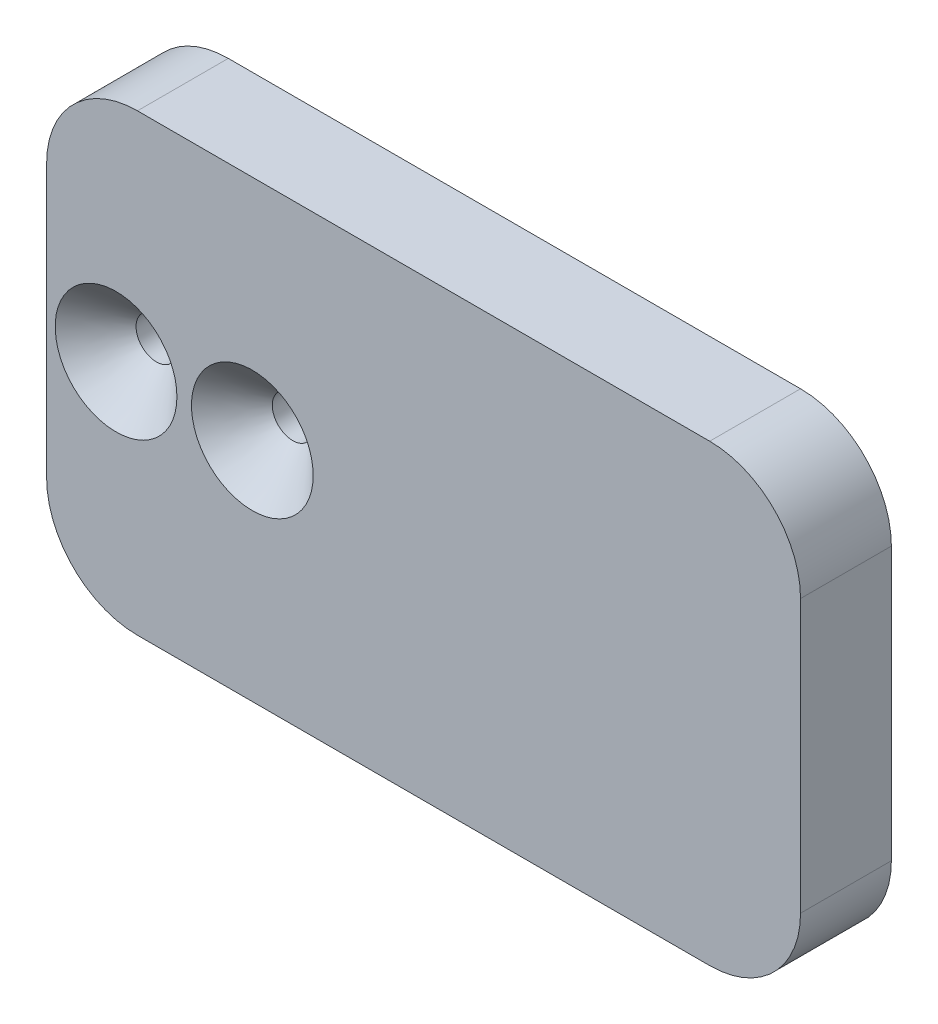
ISO-10303-21;
HEADER;
FILE_DESCRIPTION(('STEP AP214'),'2;1');
FILE_NAME('part.step','',(''),(''),'','','');
FILE_SCHEMA(('AUTOMOTIVE_DESIGN { 1 0 10303 214 1 1 1 1 }'));
ENDSEC;
DATA;
#1=APPLICATION_CONTEXT('core data for automotive mechanical design processes');
#2=APPLICATION_PROTOCOL_DEFINITION('international standard','automotive_design',2000,#1);
#3=PRODUCT_CONTEXT('',#1,'mechanical');
#4=PRODUCT('Part','Part','',(#3));
#5=PRODUCT_RELATED_PRODUCT_CATEGORY('part','',(#4));
#6=PRODUCT_DEFINITION_FORMATION('','',#4);
#7=PRODUCT_DEFINITION_CONTEXT('part definition',#1,'design');
#8=PRODUCT_DEFINITION('design','',#6,#7);
#9=PRODUCT_DEFINITION_SHAPE('','',#8);
#10=(LENGTH_UNIT() NAMED_UNIT(*) SI_UNIT(.MILLI.,.METRE.));
#11=(NAMED_UNIT(*) PLANE_ANGLE_UNIT() SI_UNIT($,.RADIAN.));
#12=(NAMED_UNIT(*) SI_UNIT($,.STERADIAN.) SOLID_ANGLE_UNIT());
#13=UNCERTAINTY_MEASURE_WITH_UNIT(LENGTH_MEASURE(1.E-05),#10,'distance_accuracy_value','');
#14=(GEOMETRIC_REPRESENTATION_CONTEXT(3) GLOBAL_UNCERTAINTY_ASSIGNED_CONTEXT((#13)) GLOBAL_UNIT_ASSIGNED_CONTEXT((#10,
#11,#12)) REPRESENTATION_CONTEXT('',''));
#15=CARTESIAN_POINT('',(0.,0.,0.));
#16=DIRECTION('',(0.,0.,1.));
#17=DIRECTION('',(1.,0.,0.));
#18=AXIS2_PLACEMENT_3D('',#15,#16,#17);
#19=CARTESIAN_POINT('',(-43.3601903788555,-3.481261930923,61.0555127546399));
#20=DIRECTION('',(0.,1.,0.));
#21=DIRECTION('',(0.,0.,1.));
#22=AXIS2_PLACEMENT_3D('',#19,#20,#21);
#23=PLANE('',#22);
#24=DIRECTION('',(0.,0.,-1.));
#25=VECTOR('',#24,1.);
#26=CARTESIAN_POINT('',(-43.3601903788555,-3.481261930923,61.0555127546399));
#27=LINE('',#26,#25);
#28=CARTESIAN_POINT('',(-43.3601903788555,-3.481261930923,5.));
#29=VERTEX_POINT('',#28);
#30=CARTESIAN_POINT('',(-43.3601903788555,-3.481261930923,3.));
#31=VERTEX_POINT('',#30);
#32=EDGE_CURVE('E378',#29,#31,#27,.T.);
#33=ORIENTED_EDGE('',*,*,#32,.T.);
#34=DIRECTION('',(1.,0.,0.));
#35=VECTOR('',#34,1.);
#36=CARTESIAN_POINT('',(-43.3601903788555,-3.481261930923,3.));
#37=LINE('',#36,#35);
#38=CARTESIAN_POINT('',(-13.3601903788555,-3.481261930923,3.));
#39=VERTEX_POINT('',#38);
#40=EDGE_CURVE('E430',#31,#39,#37,.T.);
#41=ORIENTED_EDGE('',*,*,#40,.T.);
#42=DIRECTION('',(0.,0.,-1.));
#43=VECTOR('',#42,1.);
#44=CARTESIAN_POINT('',(-13.3601903788555,-3.481261930923,61.0555127546399));
#45=LINE('',#44,#43);
#46=CARTESIAN_POINT('',(-13.3601903788555,-3.481261930923,5.));
#47=VERTEX_POINT('',#46);
#48=EDGE_CURVE('E381',#47,#39,#45,.T.);
#49=ORIENTED_EDGE('',*,*,#48,.F.);
#50=DIRECTION('',(1.,0.,0.));
#51=VECTOR('',#50,1.);
#52=CARTESIAN_POINT('',(-43.3601903788555,-3.481261930923,5.));
#53=LINE('',#52,#51);
#54=EDGE_CURVE('E274',#47,#29,#53,.F.);
#55=ORIENTED_EDGE('',*,*,#54,.T.);
#56=EDGE_LOOP('',(#33,#41,#49,#55));
#57=FACE_BOUND('',#56,.T.);
#58=ADVANCED_FACE('F53',(#57),#23,.F.);
#59=CARTESIAN_POINT('',(-13.3601903788555,16.518738069077,61.0555127546399));
#60=DIRECTION('',(-1.,0.,0.));
#61=DIRECTION('',(0.,0.,1.));
#62=AXIS2_PLACEMENT_3D('',#59,#60,#61);
#63=PLANE('',#62);
#64=ORIENTED_EDGE('',*,*,#48,.T.);
#65=DIRECTION('',(0.,1.,0.));
#66=VECTOR('',#65,1.);
#67=CARTESIAN_POINT('',(-13.3601903788555,16.518738069077,3.));
#68=LINE('',#67,#66);
#69=CARTESIAN_POINT('',(-13.3601903788555,16.518738069077,3.));
#70=VERTEX_POINT('',#69);
#71=EDGE_CURVE('E394',#39,#70,#68,.T.);
#72=ORIENTED_EDGE('',*,*,#71,.T.);
#73=DIRECTION('',(0.,0.,-1.));
#74=VECTOR('',#73,1.);
#75=CARTESIAN_POINT('',(-13.3601903788555,16.518738069077,61.0555127546399));
#76=LINE('',#75,#74);
#77=CARTESIAN_POINT('',(-13.3601903788555,16.518738069077,5.));
#78=VERTEX_POINT('',#77);
#79=EDGE_CURVE('E221',#78,#70,#76,.T.);
#80=ORIENTED_EDGE('',*,*,#79,.F.);
#81=DIRECTION('',(0.,1.,0.));
#82=VECTOR('',#81,1.);
#83=CARTESIAN_POINT('',(-13.3601903788555,-3.481261930923,5.));
#84=LINE('',#83,#82);
#85=EDGE_CURVE('E277',#78,#47,#84,.F.);
#86=ORIENTED_EDGE('',*,*,#85,.T.);
#87=EDGE_LOOP('',(#64,#72,#80,#86));
#88=FACE_BOUND('',#87,.T.);
#89=ADVANCED_FACE('F325',(#88),#63,.F.);
#90=CARTESIAN_POINT('',(-43.3601903788555,16.518738069077,61.0555127546399));
#91=DIRECTION('',(0.,-1.,0.));
#92=DIRECTION('',(0.,0.,-1.));
#93=AXIS2_PLACEMENT_3D('',#90,#91,#92);
#94=PLANE('',#93);
#95=ORIENTED_EDGE('',*,*,#79,.T.);
#96=DIRECTION('',(-1.,0.,0.));
#97=VECTOR('',#96,1.);
#98=CARTESIAN_POINT('',(-43.3601903788555,16.518738069077,3.));
#99=LINE('',#98,#97);
#100=CARTESIAN_POINT('',(-43.3601903788555,16.518738069077,3.));
#101=VERTEX_POINT('',#100);
#102=EDGE_CURVE('E63',#70,#101,#99,.T.);
#103=ORIENTED_EDGE('',*,*,#102,.T.);
#104=DIRECTION('',(0.,0.,-1.));
#105=VECTOR('',#104,1.);
#106=CARTESIAN_POINT('',(-43.3601903788555,16.518738069077,61.0555127546399));
#107=LINE('',#106,#105);
#108=CARTESIAN_POINT('',(-43.3601903788555,16.518738069077,5.));
#109=VERTEX_POINT('',#108);
#110=EDGE_CURVE('E224',#109,#101,#107,.T.);
#111=ORIENTED_EDGE('',*,*,#110,.F.);
#112=DIRECTION('',(-1.,0.,0.));
#113=VECTOR('',#112,1.);
#114=CARTESIAN_POINT('',(-13.3601903788555,16.518738069077,5.));
#115=LINE('',#114,#113);
#116=EDGE_CURVE('E280',#109,#78,#115,.F.);
#117=ORIENTED_EDGE('',*,*,#116,.T.);
#118=EDGE_LOOP('',(#95,#103,#111,#117));
#119=FACE_BOUND('',#118,.T.);
#120=ADVANCED_FACE('F330',(#119),#94,.F.);
#121=CARTESIAN_POINT('',(-43.3601903788555,16.518738069077,61.0555127546399));
#122=DIRECTION('',(1.,0.,0.));
#123=DIRECTION('',(0.,0.,-1.));
#124=AXIS2_PLACEMENT_3D('',#121,#122,#123);
#125=PLANE('',#124);
#126=ORIENTED_EDGE('',*,*,#110,.T.);
#127=DIRECTION('',(0.,-1.,0.));
#128=VECTOR('',#127,1.);
#129=CARTESIAN_POINT('',(-43.3601903788555,16.518738069077,3.));
#130=LINE('',#129,#128);
#131=EDGE_CURVE('E11',#101,#31,#130,.T.);
#132=ORIENTED_EDGE('',*,*,#131,.T.);
#133=ORIENTED_EDGE('',*,*,#32,.F.);
#134=CARTESIAN_POINT('',(-43.3601903788555,-13.481261930923,5.));
#135=DIRECTION('',(1.,0.,0.));
#136=DIRECTION('',(0.,0.,-1.));
#137=AXIS2_PLACEMENT_3D('',#134,#135,#136);
#138=CIRCLE('',#137,10.);
#139=CARTESIAN_POINT('',(-43.3601903788555,-8.48126193092301,13.6602540378444));
#140=VERTEX_POINT('',#139);
#141=EDGE_CURVE('E283',#29,#140,#138,.T.);
#142=ORIENTED_EDGE('',*,*,#141,.T.);
#143=DIRECTION('',(0.,0.,1.));
#144=VECTOR('',#143,1.);
#145=CARTESIAN_POINT('',(-43.3601903788555,-8.48126193092301,25.));
#146=LINE('',#145,#144);
#147=CARTESIAN_POINT('',(-43.3601903788555,-8.48126193092301,25.));
#148=VERTEX_POINT('',#147);
#149=EDGE_CURVE('E260',#140,#148,#146,.T.);
#150=ORIENTED_EDGE('',*,*,#149,.T.);
#151=DIRECTION('',(0.,-1.,0.));
#152=VECTOR('',#151,1.);
#153=CARTESIAN_POINT('',(-43.3601903788555,16.518738069077,25.));
#154=LINE('',#153,#152);
#155=CARTESIAN_POINT('',(-43.3601903788555,21.518738069077,25.));
#156=VERTEX_POINT('',#155);
#157=EDGE_CURVE('E211',#156,#148,#154,.T.);
#158=ORIENTED_EDGE('',*,*,#157,.F.);
#159=DIRECTION('',(0.,0.,1.));
#160=VECTOR('',#159,1.);
#161=CARTESIAN_POINT('',(-43.3601903788555,21.518738069077,15.));
#162=LINE('',#161,#160);
#163=CARTESIAN_POINT('',(-43.3601903788555,21.518738069077,13.6602540378444));
#164=VERTEX_POINT('',#163);
#165=EDGE_CURVE('E257',#156,#164,#162,.F.);
#166=ORIENTED_EDGE('',*,*,#165,.T.);
#167=CARTESIAN_POINT('',(-43.3601903788555,26.518738069077,5.));
#168=DIRECTION('',(1.,0.,0.));
#169=DIRECTION('',(0.,0.,-1.));
#170=AXIS2_PLACEMENT_3D('',#167,#168,#169);
#171=CIRCLE('',#170,10.);
#172=EDGE_CURVE('E414',#164,#109,#171,.T.);
#173=ORIENTED_EDGE('',*,*,#172,.T.);
#174=EDGE_LOOP('',(#126,#132,#133,#142,#150,#158,#166,#173));
#175=FACE_BOUND('',#174,.T.);
#176=ADVANCED_FACE('F335',(#175),#125,.F.);
#177=CARTESIAN_POINT('',(0.,0.,0.));
#178=DIRECTION('',(0.,0.,1.));
#179=DIRECTION('',(1.,0.,0.));
#180=AXIS2_PLACEMENT_3D('',#177,#178,#179);
#181=PLANE('',#180);
#182=DIRECTION('',(-1.,0.,0.));
#183=VECTOR('',#182,1.);
#184=CARTESIAN_POINT('',(0.,13.518738069077,0.));
#185=LINE('',#184,#183);
#186=CARTESIAN_POINT('',(-40.3601903788555,13.518738069077,0.));
#187=VERTEX_POINT('',#186);
#188=CARTESIAN_POINT('',(-16.3601903788555,13.518738069077,0.));
#189=VERTEX_POINT('',#188);
#190=EDGE_CURVE('E420',#187,#189,#185,.F.);
#191=ORIENTED_EDGE('',*,*,#190,.T.);
#192=DIRECTION('',(0.,1.,0.));
#193=VECTOR('',#192,1.);
#194=CARTESIAN_POINT('',(-16.3601903788555,0.,0.));
#195=LINE('',#194,#193);
#196=CARTESIAN_POINT('',(-16.3601903788555,-0.481261930923005,0.));
#197=VERTEX_POINT('',#196);
#198=EDGE_CURVE('E426',#189,#197,#195,.F.);
#199=ORIENTED_EDGE('',*,*,#198,.T.);
#200=DIRECTION('',(1.,0.,0.));
#201=VECTOR('',#200,1.);
#202=CARTESIAN_POINT('',(0.,-0.481261930923005,0.));
#203=LINE('',#202,#201);
#204=CARTESIAN_POINT('',(-40.3601903788555,-0.481261930923005,0.));
#205=VERTEX_POINT('',#204);
#206=EDGE_CURVE('E423',#197,#205,#203,.F.);
#207=ORIENTED_EDGE('',*,*,#206,.T.);
#208=DIRECTION('',(0.,-1.,0.));
#209=VECTOR('',#208,1.);
#210=CARTESIAN_POINT('',(-40.3601903788555,0.,0.));
#211=LINE('',#210,#209);
#212=EDGE_CURVE('E418',#205,#187,#211,.F.);
#213=ORIENTED_EDGE('',*,*,#212,.T.);
#214=EDGE_LOOP('',(#191,#199,#207,#213));
#215=FACE_BOUND('',#214,.T.);
#216=CARTESIAN_POINT('',(-35.7149413892325,6.42187629455118,0.));
#217=DIRECTION('',(0.,0.,1.));
#218=DIRECTION('',(1.,0.,0.));
#219=AXIS2_PLACEMENT_3D('',#216,#217,#218);
#220=CIRCLE('',#219,2.25);
#221=CARTESIAN_POINT('',(-33.4649413892325,6.42187629455118,0.));
#222=VERTEX_POINT('',#221);
#223=EDGE_CURVE('E665',#222,#222,#220,.T.);
#224=ORIENTED_EDGE('',*,*,#223,.T.);
#225=EDGE_LOOP('',(#224));
#226=FACE_BOUND('',#225,.T.);
#227=CARTESIAN_POINT('',(-20.7149413892325,6.42187629455118,0.));
#228=DIRECTION('',(0.,0.,1.));
#229=DIRECTION('',(1.,0.,0.));
#230=AXIS2_PLACEMENT_3D('',#227,#228,#229);
#231=CIRCLE('',#230,2.25);
#232=CARTESIAN_POINT('',(-18.4649413892325,6.42187629455118,0.));
#233=VERTEX_POINT('',#232);
#234=EDGE_CURVE('E373',#233,#233,#231,.T.);
#235=ORIENTED_EDGE('',*,*,#234,.T.);
#236=EDGE_LOOP('',(#235));
#237=FACE_BOUND('',#236,.T.);
#238=ADVANCED_FACE('F338',(#215,#226,#237),#181,.F.);
#239=CARTESIAN_POINT('',(0.,0.,25.));
#240=DIRECTION('',(0.,0.,1.));
#241=DIRECTION('',(1.,0.,0.));
#242=AXIS2_PLACEMENT_3D('',#239,#240,#241);
#243=PLANE('',#242);
#244=CARTESIAN_POINT('',(-35.7149413892325,6.42187629455118,25.));
#245=DIRECTION('',(0.,0.,1.));
#246=DIRECTION('',(1.,0.,0.));
#247=AXIS2_PLACEMENT_3D('',#244,#245,#246);
#248=CIRCLE('',#247,6.7);
#249=CARTESIAN_POINT('',(-29.0149413892325,6.42187629455118,25.));
#250=VERTEX_POINT('',#249);
#251=EDGE_CURVE('E403',#250,#250,#248,.T.);
#252=ORIENTED_EDGE('',*,*,#251,.F.);
#253=EDGE_LOOP('',(#252));
#254=FACE_BOUND('',#253,.T.);
#255=CARTESIAN_POINT('',(-20.7149413892325,6.42187629455118,25.));
#256=DIRECTION('',(0.,0.,1.));
#257=DIRECTION('',(1.,0.,0.));
#258=AXIS2_PLACEMENT_3D('',#255,#256,#257);
#259=CIRCLE('',#258,6.7);
#260=CARTESIAN_POINT('',(-14.0149413892325,6.42187629455118,25.));
#261=VERTEX_POINT('',#260);
#262=EDGE_CURVE('E675',#261,#261,#259,.T.);
#263=ORIENTED_EDGE('',*,*,#262,.F.);
#264=EDGE_LOOP('',(#263));
#265=FACE_BOUND('',#264,.T.);
#266=DIRECTION('',(0.,1.,0.));
#267=VECTOR('',#266,1.);
#268=CARTESIAN_POINT('',(39.6398096211445,-18.481261930923,25.));
#269=LINE('',#268,#267);
#270=CARTESIAN_POINT('',(39.6398096211445,-8.481261930923,25.));
#271=VERTEX_POINT('',#270);
#272=CARTESIAN_POINT('',(39.6398096211445,21.518738069077,25.));
#273=VERTEX_POINT('',#272);
#274=EDGE_CURVE('E185',#271,#273,#269,.T.);
#275=ORIENTED_EDGE('',*,*,#274,.T.);
#276=CARTESIAN_POINT('',(29.6398096211445,21.518738069077,25.));
#277=DIRECTION('',(0.,0.,1.));
#278=DIRECTION('',(1.,0.,0.));
#279=AXIS2_PLACEMENT_3D('',#276,#277,#278);
#280=CIRCLE('',#279,10.);
#281=CARTESIAN_POINT('',(29.6398096211445,31.518738069077,25.));
#282=VERTEX_POINT('',#281);
#283=EDGE_CURVE('E193',#273,#282,#280,.T.);
#284=ORIENTED_EDGE('',*,*,#283,.T.);
#285=DIRECTION('',(-1.,0.,0.));
#286=VECTOR('',#285,1.);
#287=CARTESIAN_POINT('',(39.6398096211445,31.518738069077,25.));
#288=LINE('',#287,#286);
#289=CARTESIAN_POINT('',(-33.3601903788555,31.518738069077,25.));
#290=VERTEX_POINT('',#289);
#291=EDGE_CURVE('E205',#282,#290,#288,.T.);
#292=ORIENTED_EDGE('',*,*,#291,.T.);
#293=CARTESIAN_POINT('',(-33.3601903788555,21.518738069077,25.));
#294=DIRECTION('',(0.,0.,1.));
#295=DIRECTION('',(1.,0.,0.));
#296=AXIS2_PLACEMENT_3D('',#293,#294,#295);
#297=CIRCLE('',#296,10.);
#298=EDGE_CURVE('E217',#290,#156,#297,.T.);
#299=ORIENTED_EDGE('',*,*,#298,.T.);
#300=ORIENTED_EDGE('',*,*,#157,.T.);
#301=CARTESIAN_POINT('',(-33.3601903788555,-8.48126193092301,25.));
#302=DIRECTION('',(0.,0.,1.));
#303=DIRECTION('',(1.,0.,0.));
#304=AXIS2_PLACEMENT_3D('',#301,#302,#303);
#305=CIRCLE('',#304,10.);
#306=CARTESIAN_POINT('',(-33.3601903788555,-18.481261930923,25.));
#307=VERTEX_POINT('',#306);
#308=EDGE_CURVE('E194',#148,#307,#305,.T.);
#309=ORIENTED_EDGE('',*,*,#308,.T.);
#310=DIRECTION('',(1.,0.,0.));
#311=VECTOR('',#310,1.);
#312=CARTESIAN_POINT('',(39.6398096211445,-18.481261930923,25.));
#313=LINE('',#312,#311);
#314=CARTESIAN_POINT('',(29.6398096211445,-18.481261930923,25.));
#315=VERTEX_POINT('',#314);
#316=EDGE_CURVE('E187',#307,#315,#313,.T.);
#317=ORIENTED_EDGE('',*,*,#316,.T.);
#318=CARTESIAN_POINT('',(29.6398096211445,-8.481261930923,25.));
#319=DIRECTION('',(0.,0.,1.));
#320=DIRECTION('',(1.,0.,0.));
#321=AXIS2_PLACEMENT_3D('',#318,#319,#320);
#322=CIRCLE('',#321,10.);
#323=EDGE_CURVE('E182',#315,#271,#322,.T.);
#324=ORIENTED_EDGE('',*,*,#323,.T.);
#325=EDGE_LOOP('',(#275,#284,#292,#299,#300,#309,#317,#324));
#326=FACE_BOUND('',#325,.T.);
#327=ADVANCED_FACE('F184',(#254,#265,#326),#243,.T.);
#328=CARTESIAN_POINT('',(0.,0.,15.));
#329=DIRECTION('',(0.,0.,1.));
#330=DIRECTION('',(1.,0.,0.));
#331=AXIS2_PLACEMENT_3D('',#328,#329,#330);
#332=PLANE('',#331);
#333=CARTESIAN_POINT('',(-33.3601903788555,-8.48126193092301,15.));
#334=DIRECTION('',(0.,0.,1.));
#335=DIRECTION('',(1.,0.,0.));
#336=AXIS2_PLACEMENT_3D('',#333,#334,#335);
#337=CIRCLE('',#336,10.);
#338=CARTESIAN_POINT('',(-33.3601903788555,-18.481261930923,15.));
#339=VERTEX_POINT('',#338);
#340=CARTESIAN_POINT('',(-42.0204444166999,-13.481261930923,15.));
#341=VERTEX_POINT('',#340);
#342=EDGE_CURVE('E242',#339,#341,#337,.F.);
#343=ORIENTED_EDGE('',*,*,#342,.T.);
#344=DIRECTION('',(1.,0.,0.));
#345=VECTOR('',#344,1.);
#346=CARTESIAN_POINT('',(-13.3601903788555,-13.481261930923,15.));
#347=LINE('',#346,#345);
#348=CARTESIAN_POINT('',(-3.3601903788555,-13.481261930923,15.));
#349=VERTEX_POINT('',#348);
#350=EDGE_CURVE('E270',#341,#349,#347,.T.);
#351=ORIENTED_EDGE('',*,*,#350,.T.);
#352=DIRECTION('',(0.,1.,0.));
#353=VECTOR('',#352,1.);
#354=CARTESIAN_POINT('',(-3.3601903788555,16.518738069077,15.));
#355=LINE('',#354,#353);
#356=CARTESIAN_POINT('',(-3.3601903788555,26.518738069077,15.));
#357=VERTEX_POINT('',#356);
#358=EDGE_CURVE('E267',#349,#357,#355,.T.);
#359=ORIENTED_EDGE('',*,*,#358,.T.);
#360=DIRECTION('',(-1.,0.,0.));
#361=VECTOR('',#360,1.);
#362=CARTESIAN_POINT('',(-43.3601903788555,26.518738069077,15.));
#363=LINE('',#362,#361);
#364=CARTESIAN_POINT('',(-42.0204444166999,26.518738069077,15.));
#365=VERTEX_POINT('',#364);
#366=EDGE_CURVE('E264',#357,#365,#363,.T.);
#367=ORIENTED_EDGE('',*,*,#366,.T.);
#368=CARTESIAN_POINT('',(-33.3601903788555,21.518738069077,15.));
#369=DIRECTION('',(0.,0.,1.));
#370=DIRECTION('',(1.,0.,0.));
#371=AXIS2_PLACEMENT_3D('',#368,#369,#370);
#372=CIRCLE('',#371,10.);
#373=CARTESIAN_POINT('',(-33.3601903788555,31.518738069077,15.));
#374=VERTEX_POINT('',#373);
#375=EDGE_CURVE('E239',#365,#374,#372,.F.);
#376=ORIENTED_EDGE('',*,*,#375,.T.);
#377=DIRECTION('',(-1.,0.,0.));
#378=VECTOR('',#377,1.);
#379=CARTESIAN_POINT('',(39.6398096211445,31.518738069077,15.));
#380=LINE('',#379,#378);
#381=CARTESIAN_POINT('',(29.6398096211445,31.518738069077,15.));
#382=VERTEX_POINT('',#381);
#383=EDGE_CURVE('E358',#382,#374,#380,.T.);
#384=ORIENTED_EDGE('',*,*,#383,.F.);
#385=CARTESIAN_POINT('',(29.6398096211445,21.518738069077,15.));
#386=DIRECTION('',(0.,0.,1.));
#387=DIRECTION('',(1.,0.,0.));
#388=AXIS2_PLACEMENT_3D('',#385,#386,#387);
#389=CIRCLE('',#388,10.);
#390=CARTESIAN_POINT('',(39.6398096211445,21.518738069077,15.));
#391=VERTEX_POINT('',#390);
#392=EDGE_CURVE('E248',#382,#391,#389,.F.);
#393=ORIENTED_EDGE('',*,*,#392,.T.);
#394=DIRECTION('',(0.,1.,0.));
#395=VECTOR('',#394,1.);
#396=CARTESIAN_POINT('',(39.6398096211445,-18.481261930923,15.));
#397=LINE('',#396,#395);
#398=CARTESIAN_POINT('',(39.6398096211445,-8.481261930923,15.));
#399=VERTEX_POINT('',#398);
#400=EDGE_CURVE('E356',#399,#391,#397,.T.);
#401=ORIENTED_EDGE('',*,*,#400,.F.);
#402=CARTESIAN_POINT('',(29.6398096211445,-8.481261930923,15.));
#403=DIRECTION('',(0.,0.,1.));
#404=DIRECTION('',(1.,0.,0.));
#405=AXIS2_PLACEMENT_3D('',#402,#403,#404);
#406=CIRCLE('',#405,10.);
#407=CARTESIAN_POINT('',(29.6398096211445,-18.481261930923,15.));
#408=VERTEX_POINT('',#407);
#409=EDGE_CURVE('E209',#399,#408,#406,.F.);
#410=ORIENTED_EDGE('',*,*,#409,.T.);
#411=DIRECTION('',(1.,0.,0.));
#412=VECTOR('',#411,1.);
#413=CARTESIAN_POINT('',(39.6398096211445,-18.481261930923,15.));
#414=LINE('',#413,#412);
#415=EDGE_CURVE('E360',#339,#408,#414,.T.);
#416=ORIENTED_EDGE('',*,*,#415,.F.);
#417=EDGE_LOOP('',(#343,#351,#359,#367,#376,#384,#393,#401,#410,#416));
#418=FACE_BOUND('',#417,.T.);
#419=ADVANCED_FACE('F340',(#418),#332,.F.);
#420=CARTESIAN_POINT('',(39.6398096211445,31.518738069077,15.));
#421=DIRECTION('',(0.,1.,0.));
#422=DIRECTION('',(-1.,0.,0.));
#423=AXIS2_PLACEMENT_3D('',#420,#421,#422);
#424=PLANE('',#423);
#425=ORIENTED_EDGE('',*,*,#291,.F.);
#426=DIRECTION('',(0.,0.,1.));
#427=VECTOR('',#426,1.);
#428=CARTESIAN_POINT('',(29.6398096211445,31.518738069077,15.));
#429=LINE('',#428,#427);
#430=EDGE_CURVE('E236',#282,#382,#429,.F.);
#431=ORIENTED_EDGE('',*,*,#430,.T.);
#432=ORIENTED_EDGE('',*,*,#383,.T.);
#433=DIRECTION('',(0.,0.,1.));
#434=VECTOR('',#433,1.);
#435=CARTESIAN_POINT('',(-33.3601903788555,31.518738069077,25.));
#436=LINE('',#435,#434);
#437=EDGE_CURVE('E232',#374,#290,#436,.T.);
#438=ORIENTED_EDGE('',*,*,#437,.T.);
#439=EDGE_LOOP('',(#425,#431,#432,#438));
#440=FACE_BOUND('',#439,.T.);
#441=ADVANCED_FACE('F468',(#440),#424,.T.);
#442=CARTESIAN_POINT('',(39.6398096211445,-18.481261930923,15.));
#443=DIRECTION('',(1.,0.,0.));
#444=DIRECTION('',(0.,0.,-1.));
#445=AXIS2_PLACEMENT_3D('',#442,#443,#444);
#446=PLANE('',#445);
#447=ORIENTED_EDGE('',*,*,#400,.T.);
#448=DIRECTION('',(0.,0.,1.));
#449=VECTOR('',#448,1.);
#450=CARTESIAN_POINT('',(39.6398096211445,21.518738069077,15.));
#451=LINE('',#450,#449);
#452=EDGE_CURVE('E203',#391,#273,#451,.T.);
#453=ORIENTED_EDGE('',*,*,#452,.T.);
#454=ORIENTED_EDGE('',*,*,#274,.F.);
#455=DIRECTION('',(0.,0.,1.));
#456=VECTOR('',#455,1.);
#457=CARTESIAN_POINT('',(39.6398096211445,-8.481261930923,15.));
#458=LINE('',#457,#456);
#459=EDGE_CURVE('E200',#271,#399,#458,.F.);
#460=ORIENTED_EDGE('',*,*,#459,.T.);
#461=EDGE_LOOP('',(#447,#453,#454,#460));
#462=FACE_BOUND('',#461,.T.);
#463=ADVANCED_FACE('F199',(#462),#446,.T.);
#464=CARTESIAN_POINT('',(39.6398096211445,-18.481261930923,15.));
#465=DIRECTION('',(0.,-1.,0.));
#466=DIRECTION('',(1.,0.,0.));
#467=AXIS2_PLACEMENT_3D('',#464,#465,#466);
#468=PLANE('',#467);
#469=ORIENTED_EDGE('',*,*,#415,.T.);
#470=DIRECTION('',(0.,0.,1.));
#471=VECTOR('',#470,1.);
#472=CARTESIAN_POINT('',(29.6398096211445,-18.481261930923,15.));
#473=LINE('',#472,#471);
#474=EDGE_CURVE('E254',#408,#315,#473,.T.);
#475=ORIENTED_EDGE('',*,*,#474,.T.);
#476=ORIENTED_EDGE('',*,*,#316,.F.);
#477=DIRECTION('',(0.,0.,1.));
#478=VECTOR('',#477,1.);
#479=CARTESIAN_POINT('',(-33.3601903788555,-18.481261930923,15.));
#480=LINE('',#479,#478);
#481=EDGE_CURVE('E251',#307,#339,#480,.F.);
#482=ORIENTED_EDGE('',*,*,#481,.T.);
#483=EDGE_LOOP('',(#469,#475,#476,#482));
#484=FACE_BOUND('',#483,.T.);
#485=ADVANCED_FACE('F461',(#484),#468,.T.);
#486=CARTESIAN_POINT('',(-20.7149413892325,6.42187629455118,25.));
#487=DIRECTION('',(0.,0.,1.));
#488=DIRECTION('',(1.,0.,0.));
#489=AXIS2_PLACEMENT_3D('',#486,#487,#488);
#490=CYLINDRICAL_SURFACE('',#489,2.25);
#491=ORIENTED_EDGE('',*,*,#234,.F.);
#492=EDGE_LOOP('',(#491));
#493=FACE_BOUND('',#492,.T.);
#494=CARTESIAN_POINT('',(-20.7149413892325,6.42187629455118,20.55));
#495=DIRECTION('',(0.,0.,1.));
#496=DIRECTION('',(1.,0.,0.));
#497=AXIS2_PLACEMENT_3D('',#494,#495,#496);
#498=CIRCLE('',#497,2.25);
#499=CARTESIAN_POINT('',(-18.4649413892325,6.42187629455118,20.55));
#500=VERTEX_POINT('',#499);
#501=EDGE_CURVE('E670',#500,#500,#498,.T.);
#502=ORIENTED_EDGE('',*,*,#501,.T.);
#503=EDGE_LOOP('',(#502));
#504=FACE_BOUND('',#503,.T.);
#505=ADVANCED_FACE('F480',(#493,#504),#490,.F.);
#506=CARTESIAN_POINT('',(-20.7149413892325,6.42187629455118,25.));
#507=DIRECTION('',(0.,0.,1.));
#508=DIRECTION('',(1.,0.,0.));
#509=AXIS2_PLACEMENT_3D('',#506,#507,#508);
#510=CONICAL_SURFACE('',#509,6.7,0.785398163397449);
#511=ORIENTED_EDGE('',*,*,#501,.F.);
#512=EDGE_LOOP('',(#511));
#513=FACE_BOUND('',#512,.T.);
#514=ORIENTED_EDGE('',*,*,#262,.T.);
#515=EDGE_LOOP('',(#514));
#516=FACE_BOUND('',#515,.T.);
#517=ADVANCED_FACE('F695',(#513,#516),#510,.F.);
#518=CARTESIAN_POINT('',(-35.7149413892325,6.42187629455118,25.));
#519=DIRECTION('',(0.,0.,1.));
#520=DIRECTION('',(1.,0.,0.));
#521=AXIS2_PLACEMENT_3D('',#518,#519,#520);
#522=CYLINDRICAL_SURFACE('',#521,2.25);
#523=ORIENTED_EDGE('',*,*,#223,.F.);
#524=EDGE_LOOP('',(#523));
#525=FACE_BOUND('',#524,.T.);
#526=CARTESIAN_POINT('',(-35.7149413892325,6.42187629455118,20.55));
#527=DIRECTION('',(0.,0.,1.));
#528=DIRECTION('',(1.,0.,0.));
#529=AXIS2_PLACEMENT_3D('',#526,#527,#528);
#530=CIRCLE('',#529,2.25);
#531=CARTESIAN_POINT('',(-33.4649413892325,6.42187629455118,20.55));
#532=VERTEX_POINT('',#531);
#533=EDGE_CURVE('E683',#532,#532,#530,.T.);
#534=ORIENTED_EDGE('',*,*,#533,.T.);
#535=EDGE_LOOP('',(#534));
#536=FACE_BOUND('',#535,.T.);
#537=ADVANCED_FACE('F349',(#525,#536),#522,.F.);
#538=CARTESIAN_POINT('',(-35.7149413892325,6.42187629455118,25.));
#539=DIRECTION('',(0.,0.,1.));
#540=DIRECTION('',(1.,0.,0.));
#541=AXIS2_PLACEMENT_3D('',#538,#539,#540);
#542=CONICAL_SURFACE('',#541,6.7,0.785398163397449);
#543=ORIENTED_EDGE('',*,*,#533,.F.);
#544=EDGE_LOOP('',(#543));
#545=FACE_BOUND('',#544,.T.);
#546=ORIENTED_EDGE('',*,*,#251,.T.);
#547=EDGE_LOOP('',(#546));
#548=FACE_BOUND('',#547,.T.);
#549=ADVANCED_FACE('F344',(#545,#548),#542,.F.);
#550=CARTESIAN_POINT('',(29.6398096211445,21.518738069077,15.));
#551=DIRECTION('',(0.,0.,1.));
#552=DIRECTION('',(1.,0.,0.));
#553=AXIS2_PLACEMENT_3D('',#550,#551,#552);
#554=CYLINDRICAL_SURFACE('',#553,10.);
#555=ORIENTED_EDGE('',*,*,#392,.F.);
#556=ORIENTED_EDGE('',*,*,#430,.F.);
#557=ORIENTED_EDGE('',*,*,#283,.F.);
#558=ORIENTED_EDGE('',*,*,#452,.F.);
#559=EDGE_LOOP('',(#555,#556,#557,#558));
#560=FACE_BOUND('',#559,.T.);
#561=ADVANCED_FACE('F342',(#560),#554,.T.);
#562=CARTESIAN_POINT('',(29.6398096211445,-8.481261930923,15.));
#563=DIRECTION('',(0.,0.,1.));
#564=DIRECTION('',(1.,0.,0.));
#565=AXIS2_PLACEMENT_3D('',#562,#563,#564);
#566=CYLINDRICAL_SURFACE('',#565,10.);
#567=ORIENTED_EDGE('',*,*,#409,.F.);
#568=ORIENTED_EDGE('',*,*,#459,.F.);
#569=ORIENTED_EDGE('',*,*,#323,.F.);
#570=ORIENTED_EDGE('',*,*,#474,.F.);
#571=EDGE_LOOP('',(#567,#568,#569,#570));
#572=FACE_BOUND('',#571,.T.);
#573=ADVANCED_FACE('F208',(#572),#566,.T.);
#574=CARTESIAN_POINT('',(-33.3601903788555,-8.48126193092301,61.0555127546399));
#575=DIRECTION('',(0.,0.,-1.));
#576=DIRECTION('',(-1.,0.,0.));
#577=AXIS2_PLACEMENT_3D('',#574,#575,#576);
#578=CYLINDRICAL_SURFACE('',#577,10.);
#579=ORIENTED_EDGE('',*,*,#342,.F.);
#580=ORIENTED_EDGE('',*,*,#481,.F.);
#581=ORIENTED_EDGE('',*,*,#308,.F.);
#582=ORIENTED_EDGE('',*,*,#149,.F.);
#583=CARTESIAN_POINT('',(-43.3601903788555,-8.48126193092301,13.6602540378444));
#584=CARTESIAN_POINT('',(-43.360221778481,-8.66481018019817,13.7662718814835));
#585=CARTESIAN_POINT('',(-43.3551375404596,-8.85180801928341,13.86640852136));
#586=CARTESIAN_POINT('',(-43.3338239474683,-9.23133330411399,14.0544331322078));
#587=CARTESIAN_POINT('',(-43.3175901316286,-9.42386293353835,14.1423161836656));
#588=CARTESIAN_POINT('',(-43.2730675595501,-9.81288487798687,14.3052414974577));
#589=CARTESIAN_POINT('',(-43.2447817834214,-10.0093762019605,14.3802869277489));
#590=CARTESIAN_POINT('',(-43.1755276686897,-10.4046414598527,14.5172543556601));
#591=CARTESIAN_POINT('',(-43.1345620541126,-10.6034148946792,14.5791791671904));
#592=CARTESIAN_POINT('',(-43.0394316178834,-11.0020546810619,14.6900182662066));
#593=CARTESIAN_POINT('',(-42.9852307084617,-11.2019225349005,14.738896203786));
#594=CARTESIAN_POINT('',(-42.8635827531499,-11.6003840534933,14.8236341090356));
#595=CARTESIAN_POINT('',(-42.7961354948283,-11.7989776977603,14.8594938679073));
#596=CARTESIAN_POINT('',(-42.648326961637,-12.1926830029708,14.9186246526666));
#597=CARTESIAN_POINT('',(-42.5679943385301,-12.387801346192,14.9419231197315));
#598=CARTESIAN_POINT('',(-42.394724379575,-12.7733264072145,14.9767859771012));
#599=CARTESIAN_POINT('',(-42.3017941468266,-12.9637357091562,14.9883569489533));
#600=CARTESIAN_POINT('',(-42.1734964668665,-13.2066826074921,14.9963848272747));
#601=CARTESIAN_POINT('',(-42.1435992659595,-13.2620243879517,14.9977482862739));
#602=CARTESIAN_POINT('',(-42.0827874849092,-13.3720946979959,14.9995552900602));
#603=CARTESIAN_POINT('',(-42.0518738694074,-13.4268237465258,14.9999996828777));
#604=CARTESIAN_POINT('',(-42.0204444166999,-13.481261930923,15.));
#605=B_SPLINE_CURVE_WITH_KNOTS('',3,(#583,#584,#585,#586,#587,#588,#589,#590,#591,#592,#593,
#594,#595,#596,#597,#598,#599,#600,#601,#602,#603,#604),.UNSPECIFIED.,.F.,.F.,(4,2,2,2,2,2,2,2,
2,2,4),(0.,0.635797806882669,1.27185014041099,1.9077452873184,2.54350391876901,3.18101577473809,
3.81853785530785,4.4546615143495,5.09042797861824,5.27916429152552,5.46772637792502),.UNSPECIFIED.);
#606=EDGE_CURVE('E287',#140,#341,#605,.T.);
#607=ORIENTED_EDGE('',*,*,#606,.T.);
#608=EDGE_LOOP('',(#579,#580,#581,#582,#607));
#609=FACE_BOUND('',#608,.T.);
#610=ADVANCED_FACE('F307',(#609),#578,.T.);
#611=CARTESIAN_POINT('',(-33.3601903788555,21.518738069077,15.));
#612=DIRECTION('',(0.,0.,-1.));
#613=DIRECTION('',(-1.,0.,0.));
#614=AXIS2_PLACEMENT_3D('',#611,#612,#613);
#615=CYLINDRICAL_SURFACE('',#614,10.);
#616=ORIENTED_EDGE('',*,*,#375,.F.);
#617=CARTESIAN_POINT('',(-42.0204444166999,26.518738069077,15.));
#618=CARTESIAN_POINT('',(-42.1264622603389,26.3351898198018,15.0000313996255));
#619=CARTESIAN_POINT('',(-42.2265989002155,26.1481919807166,14.9949471616041));
#620=CARTESIAN_POINT('',(-42.4146235110633,25.768666695886,14.9736335686128));
#621=CARTESIAN_POINT('',(-42.5025065625211,25.5761370664617,14.9573997527731));
#622=CARTESIAN_POINT('',(-42.6654318763131,25.1871151220131,14.9128771806947));
#623=CARTESIAN_POINT('',(-42.7404773066044,24.9906237980395,14.8845914045659));
#624=CARTESIAN_POINT('',(-42.8774447345155,24.5953585401474,14.8153372898342));
#625=CARTESIAN_POINT('',(-42.9393695460459,24.3965851053208,14.7743716752571));
#626=CARTESIAN_POINT('',(-43.0502086450621,23.9979453189382,14.6792412390279));
#627=CARTESIAN_POINT('',(-43.0990865826415,23.7980774650995,14.6250403296062));
#628=CARTESIAN_POINT('',(-43.1838244878911,23.3996159465067,14.5033923742944));
#629=CARTESIAN_POINT('',(-43.2196842467628,23.2010223022397,14.4359451159728));
#630=CARTESIAN_POINT('',(-43.2788150315221,22.8073169970292,14.2881365827815));
#631=CARTESIAN_POINT('',(-43.3021134985869,22.612198653808,14.2078039596746));
#632=CARTESIAN_POINT('',(-43.3369763559567,22.2266735927855,14.0345340007195));
#633=CARTESIAN_POINT('',(-43.3485473278088,22.0362642908438,13.9416037679711));
#634=CARTESIAN_POINT('',(-43.3565752061302,21.7933173925079,13.813306088011));
#635=CARTESIAN_POINT('',(-43.3579386651294,21.7379756120483,13.783408887104));
#636=CARTESIAN_POINT('',(-43.3597456689157,21.6279053020041,13.7225971060537));
#637=CARTESIAN_POINT('',(-43.3601900617332,21.5731762534742,13.6916834905519));
#638=CARTESIAN_POINT('',(-43.3601903788555,21.518738069077,13.6602540378444));
#639=B_SPLINE_CURVE_WITH_KNOTS('',3,(#617,#618,#619,#620,#621,#622,#623,#624,#625,#626,#627,
#628,#629,#630,#631,#632,#633,#634,#635,#636,#637,#638),.UNSPECIFIED.,.F.,.F.,(4,2,2,2,2,2,2,2,
2,2,4),(0.,0.635797806882667,1.27185014041098,1.9077452873184,2.54350391876901,3.18101577473809,
3.81853785530785,4.4546615143495,5.09042797861825,5.27916429152554,5.46772637792504),.UNSPECIFIED.);
#640=EDGE_CURVE('E296',#365,#164,#639,.T.);
#641=ORIENTED_EDGE('',*,*,#640,.T.);
#642=ORIENTED_EDGE('',*,*,#165,.F.);
#643=ORIENTED_EDGE('',*,*,#298,.F.);
#644=ORIENTED_EDGE('',*,*,#437,.F.);
#645=EDGE_LOOP('',(#616,#641,#642,#643,#644));
#646=FACE_BOUND('',#645,.T.);
#647=ADVANCED_FACE('F311',(#646),#615,.T.);
#648=CARTESIAN_POINT('',(0.,26.518738069077,5.));
#649=DIRECTION('',(1.,0.,0.));
#650=DIRECTION('',(0.,0.,-1.));
#651=AXIS2_PLACEMENT_3D('',#648,#649,#650);
#652=CYLINDRICAL_SURFACE('',#651,10.);
#653=ORIENTED_EDGE('',*,*,#640,.F.);
#654=ORIENTED_EDGE('',*,*,#366,.F.);
#655=CARTESIAN_POINT('',(-3.3601903788555,26.518738069077,5.));
#656=DIRECTION('',(0.707106781186547,-0.707106781186547,0.));
#657=DIRECTION('',(0.707106781186547,0.707106781186547,0.));
#658=AXIS2_PLACEMENT_3D('',#655,#656,#657);
#659=ELLIPSE('',#658,14.1421356237309,10.);
#660=EDGE_CURVE('E397',#78,#357,#659,.F.);
#661=ORIENTED_EDGE('',*,*,#660,.F.);
#662=ORIENTED_EDGE('',*,*,#116,.F.);
#663=ORIENTED_EDGE('',*,*,#172,.F.);
#664=EDGE_LOOP('',(#653,#654,#661,#662,#663));
#665=FACE_BOUND('',#664,.T.);
#666=ADVANCED_FACE('F316',(#665),#652,.F.);
#667=CARTESIAN_POINT('',(-3.3601903788555,0.,5.));
#668=DIRECTION('',(0.,-1.,0.));
#669=DIRECTION('',(0.,0.,-1.));
#670=AXIS2_PLACEMENT_3D('',#667,#668,#669);
#671=CYLINDRICAL_SURFACE('',#670,10.);
#672=ORIENTED_EDGE('',*,*,#660,.T.);
#673=ORIENTED_EDGE('',*,*,#358,.F.);
#674=CARTESIAN_POINT('',(-3.3601903788555,-13.481261930923,5.));
#675=DIRECTION('',(-0.707106781186547,-0.707106781186547,0.));
#676=DIRECTION('',(0.707106781186547,-0.707106781186547,0.));
#677=AXIS2_PLACEMENT_3D('',#674,#675,#676);
#678=ELLIPSE('',#677,14.1421356237309,10.);
#679=EDGE_CURVE('E404',#47,#349,#678,.F.);
#680=ORIENTED_EDGE('',*,*,#679,.F.);
#681=ORIENTED_EDGE('',*,*,#85,.F.);
#682=EDGE_LOOP('',(#672,#673,#680,#681));
#683=FACE_BOUND('',#682,.T.);
#684=ADVANCED_FACE('F321',(#683),#671,.F.);
#685=CARTESIAN_POINT('',(0.,-13.481261930923,5.));
#686=DIRECTION('',(-1.,0.,0.));
#687=DIRECTION('',(0.,0.,1.));
#688=AXIS2_PLACEMENT_3D('',#685,#686,#687);
#689=CYLINDRICAL_SURFACE('',#688,10.);
#690=ORIENTED_EDGE('',*,*,#141,.F.);
#691=ORIENTED_EDGE('',*,*,#54,.F.);
#692=ORIENTED_EDGE('',*,*,#679,.T.);
#693=ORIENTED_EDGE('',*,*,#350,.F.);
#694=ORIENTED_EDGE('',*,*,#606,.F.);
#695=EDGE_LOOP('',(#690,#691,#692,#693,#694));
#696=FACE_BOUND('',#695,.T.);
#697=ADVANCED_FACE('F304',(#696),#689,.F.);
#698=CARTESIAN_POINT('',(-40.3601903788555,16.518738069077,3.));
#699=DIRECTION('',(0.,-1.,0.));
#700=DIRECTION('',(0.,0.,-1.));
#701=AXIS2_PLACEMENT_3D('',#698,#699,#700);
#702=CYLINDRICAL_SURFACE('',#701,3.);
#703=CARTESIAN_POINT('',(-40.3601903788555,13.518738069077,3.));
#704=DIRECTION('',(-0.707106781186547,-0.707106781186547,0.));
#705=DIRECTION('',(0.707106781186547,-0.707106781186547,0.));
#706=AXIS2_PLACEMENT_3D('',#703,#704,#705);
#707=ELLIPSE('',#706,4.24264068711928,3.);
#708=EDGE_CURVE('E413',#187,#101,#707,.F.);
#709=ORIENTED_EDGE('',*,*,#708,.F.);
#710=ORIENTED_EDGE('',*,*,#212,.F.);
#711=CARTESIAN_POINT('',(-40.3601903788555,-0.481261930923005,3.));
#712=DIRECTION('',(0.707106781186547,-0.707106781186547,0.));
#713=DIRECTION('',(-0.707106781186547,-0.707106781186547,0.));
#714=AXIS2_PLACEMENT_3D('',#711,#712,#713);
#715=ELLIPSE('',#714,4.24264068711928,3.);
#716=EDGE_CURVE('E57',#31,#205,#715,.T.);
#717=ORIENTED_EDGE('',*,*,#716,.F.);
#718=ORIENTED_EDGE('',*,*,#131,.F.);
#719=EDGE_LOOP('',(#709,#710,#717,#718));
#720=FACE_BOUND('',#719,.T.);
#721=ADVANCED_FACE('F55',(#720),#702,.T.);
#722=CARTESIAN_POINT('',(-43.3601903788555,-0.481261930923005,3.));
#723=DIRECTION('',(1.,0.,0.));
#724=DIRECTION('',(0.,0.,-1.));
#725=AXIS2_PLACEMENT_3D('',#722,#723,#724);
#726=CYLINDRICAL_SURFACE('',#725,3.);
#727=ORIENTED_EDGE('',*,*,#716,.T.);
#728=ORIENTED_EDGE('',*,*,#206,.F.);
#729=CARTESIAN_POINT('',(-16.3601903788555,-0.481261930923005,3.));
#730=DIRECTION('',(0.707106781186547,0.707106781186547,0.));
#731=DIRECTION('',(0.707106781186547,-0.707106781186547,0.));
#732=AXIS2_PLACEMENT_3D('',#729,#730,#731);
#733=ELLIPSE('',#732,4.24264068711928,3.);
#734=EDGE_CURVE('E437',#39,#197,#733,.T.);
#735=ORIENTED_EDGE('',*,*,#734,.F.);
#736=ORIENTED_EDGE('',*,*,#40,.F.);
#737=EDGE_LOOP('',(#727,#728,#735,#736));
#738=FACE_BOUND('',#737,.T.);
#739=ADVANCED_FACE('F454',(#738),#726,.T.);
#740=CARTESIAN_POINT('',(-43.3601903788555,13.518738069077,3.));
#741=DIRECTION('',(-1.,0.,0.));
#742=DIRECTION('',(0.,0.,1.));
#743=AXIS2_PLACEMENT_3D('',#740,#741,#742);
#744=CYLINDRICAL_SURFACE('',#743,3.);
#745=ORIENTED_EDGE('',*,*,#708,.T.);
#746=ORIENTED_EDGE('',*,*,#102,.F.);
#747=CARTESIAN_POINT('',(-16.3601903788555,13.518738069077,3.));
#748=DIRECTION('',(-0.707106781186547,0.707106781186547,0.));
#749=DIRECTION('',(-0.707106781186547,-0.707106781186547,0.));
#750=AXIS2_PLACEMENT_3D('',#747,#748,#749);
#751=ELLIPSE('',#750,4.24264068711928,3.);
#752=EDGE_CURVE('E434',#189,#70,#751,.F.);
#753=ORIENTED_EDGE('',*,*,#752,.F.);
#754=ORIENTED_EDGE('',*,*,#190,.F.);
#755=EDGE_LOOP('',(#745,#746,#753,#754));
#756=FACE_BOUND('',#755,.T.);
#757=ADVANCED_FACE('F445',(#756),#744,.T.);
#758=CARTESIAN_POINT('',(-16.3601903788555,16.518738069077,3.));
#759=DIRECTION('',(0.,1.,0.));
#760=DIRECTION('',(0.,0.,1.));
#761=AXIS2_PLACEMENT_3D('',#758,#759,#760);
#762=CYLINDRICAL_SURFACE('',#761,3.);
#763=ORIENTED_EDGE('',*,*,#734,.T.);
#764=ORIENTED_EDGE('',*,*,#198,.F.);
#765=ORIENTED_EDGE('',*,*,#752,.T.);
#766=ORIENTED_EDGE('',*,*,#71,.F.);
#767=EDGE_LOOP('',(#763,#764,#765,#766));
#768=FACE_BOUND('',#767,.T.);
#769=ADVANCED_FACE('F641',(#768),#762,.T.);
#770=CLOSED_SHELL('',(#58,#89,#120,#176,#238,#327,#419,#441,#463,#485,#505,#517,#537,#549,#561,
#573,#610,#647,#666,#684,#697,#721,#739,#757,#769));
#771=MANIFOLD_SOLID_BREP('B2',#770);
#772=ADVANCED_BREP_SHAPE_REPRESENTATION('',(#18,#771),#14);
#773=SHAPE_DEFINITION_REPRESENTATION(#9,#772);
ENDSEC;
END-ISO-10303-21;
